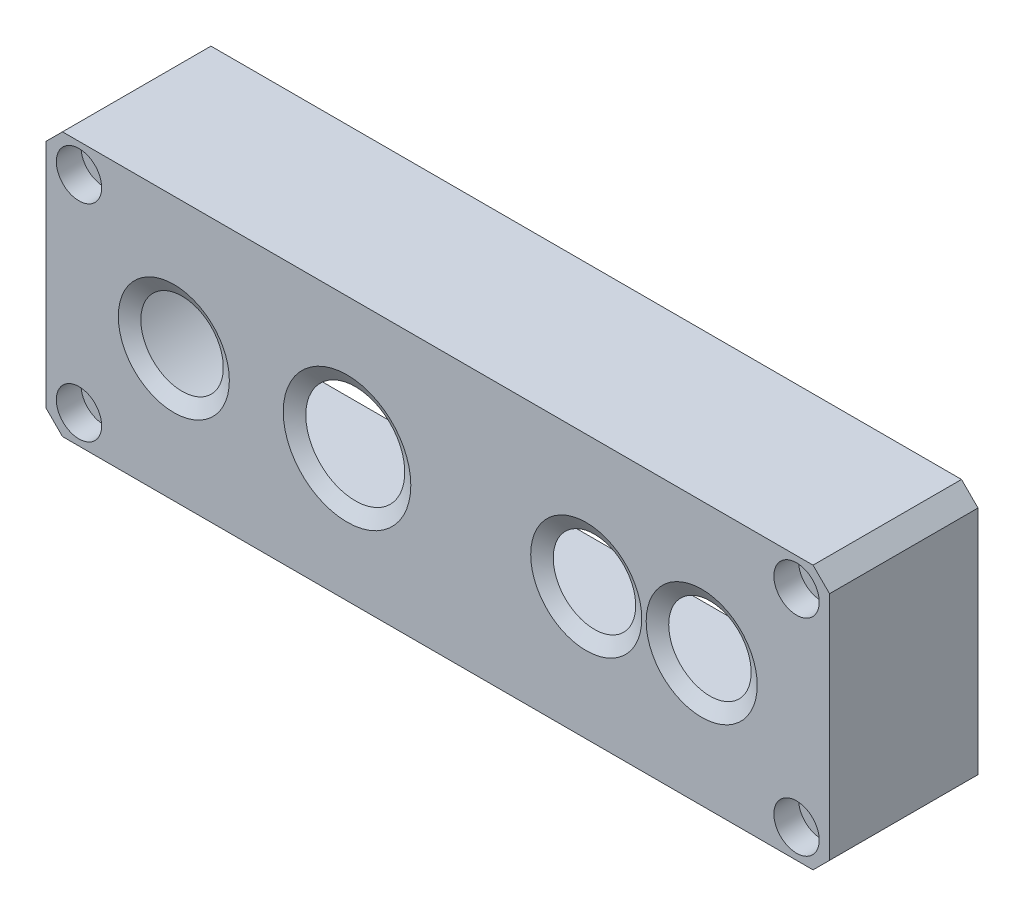
ISO-10303-21;
HEADER;
FILE_DESCRIPTION(('STEP AP214'),'2;1');
FILE_NAME('part.step','',(''),(''),'','','');
FILE_SCHEMA(('AUTOMOTIVE_DESIGN { 1 0 10303 214 1 1 1 1 }'));
ENDSEC;
DATA;
#1=APPLICATION_CONTEXT('core data for automotive mechanical design processes');
#2=APPLICATION_PROTOCOL_DEFINITION('international standard','automotive_design',2000,#1);
#3=PRODUCT_CONTEXT('',#1,'mechanical');
#4=PRODUCT('Part','Part','',(#3));
#5=PRODUCT_RELATED_PRODUCT_CATEGORY('part','',(#4));
#6=PRODUCT_DEFINITION_FORMATION('','',#4);
#7=PRODUCT_DEFINITION_CONTEXT('part definition',#1,'design');
#8=PRODUCT_DEFINITION('design','',#6,#7);
#9=PRODUCT_DEFINITION_SHAPE('','',#8);
#10=(LENGTH_UNIT() NAMED_UNIT(*) SI_UNIT(.MILLI.,.METRE.));
#11=(NAMED_UNIT(*) PLANE_ANGLE_UNIT() SI_UNIT($,.RADIAN.));
#12=(NAMED_UNIT(*) SI_UNIT($,.STERADIAN.) SOLID_ANGLE_UNIT());
#13=UNCERTAINTY_MEASURE_WITH_UNIT(LENGTH_MEASURE(1.E-05),#10,'distance_accuracy_value','');
#14=(GEOMETRIC_REPRESENTATION_CONTEXT(3) GLOBAL_UNCERTAINTY_ASSIGNED_CONTEXT((#13)) GLOBAL_UNIT_ASSIGNED_CONTEXT((#10,
#11,#12)) REPRESENTATION_CONTEXT('',''));
#15=CARTESIAN_POINT('',(0.,0.,0.));
#16=DIRECTION('',(0.,0.,1.));
#17=DIRECTION('',(1.,0.,0.));
#18=AXIS2_PLACEMENT_3D('',#15,#16,#17);
#19=CARTESIAN_POINT('',(-227.462722424265,79.6239283126375,1.));
#20=DIRECTION('',(0.,0.,-1.));
#21=DIRECTION('',(-1.,0.,0.));
#22=AXIS2_PLACEMENT_3D('',#19,#20,#21);
#23=CYLINDRICAL_SURFACE('',#22,1.30000000000001);
#24=CARTESIAN_POINT('',(-227.462722424265,79.6239283126375,-17.));
#25=DIRECTION('',(0.,0.,-1.));
#26=DIRECTION('',(-1.,0.,0.));
#27=AXIS2_PLACEMENT_3D('',#24,#25,#26);
#28=CIRCLE('',#27,1.30000000000001);
#29=CARTESIAN_POINT('',(-228.762722424265,79.6239283126375,-17.));
#30=VERTEX_POINT('',#29);
#31=EDGE_CURVE('E275',#30,#30,#28,.T.);
#32=ORIENTED_EDGE('',*,*,#31,.T.);
#33=EDGE_LOOP('',(#32));
#34=FACE_BOUND('',#33,.T.);
#35=CARTESIAN_POINT('',(-227.462722424265,79.6239283126375,-2.));
#36=DIRECTION('',(0.,0.,1.));
#37=DIRECTION('',(1.,0.,0.));
#38=AXIS2_PLACEMENT_3D('',#35,#36,#37);
#39=CIRCLE('',#38,1.30000000000001);
#40=CARTESIAN_POINT('',(-226.162722424265,79.6239283126375,-2.));
#41=VERTEX_POINT('',#40);
#42=EDGE_CURVE('E43',#41,#41,#39,.F.);
#43=ORIENTED_EDGE('',*,*,#42,.F.);
#44=EDGE_LOOP('',(#43));
#45=FACE_BOUND('',#44,.T.);
#46=ADVANCED_FACE('F39',(#34,#45),#23,.F.);
#47=CARTESIAN_POINT('',(-140.462722424265,104.623928312638,1.));
#48=DIRECTION('',(0.,0.,-1.));
#49=DIRECTION('',(-1.,0.,0.));
#50=AXIS2_PLACEMENT_3D('',#47,#48,#49);
#51=CYLINDRICAL_SURFACE('',#50,1.30000000000001);
#52=CARTESIAN_POINT('',(-140.462722424265,104.623928312638,-17.));
#53=DIRECTION('',(0.,0.,-1.));
#54=DIRECTION('',(-1.,0.,0.));
#55=AXIS2_PLACEMENT_3D('',#52,#53,#54);
#56=CIRCLE('',#55,1.30000000000001);
#57=CARTESIAN_POINT('',(-141.762722424265,104.623928312638,-17.));
#58=VERTEX_POINT('',#57);
#59=EDGE_CURVE('E259',#58,#58,#56,.T.);
#60=ORIENTED_EDGE('',*,*,#59,.T.);
#61=EDGE_LOOP('',(#60));
#62=FACE_BOUND('',#61,.T.);
#63=CARTESIAN_POINT('',(-140.462722424265,104.623928312638,-2.));
#64=DIRECTION('',(0.,0.,1.));
#65=DIRECTION('',(1.,0.,0.));
#66=AXIS2_PLACEMENT_3D('',#63,#64,#65);
#67=CIRCLE('',#66,1.30000000000001);
#68=CARTESIAN_POINT('',(-139.162722424265,104.623928312638,-2.));
#69=VERTEX_POINT('',#68);
#70=EDGE_CURVE('E254',#69,#69,#67,.F.);
#71=ORIENTED_EDGE('',*,*,#70,.F.);
#72=EDGE_LOOP('',(#71));
#73=FACE_BOUND('',#72,.T.);
#74=ADVANCED_FACE('F294',(#62,#73),#51,.F.);
#75=CARTESIAN_POINT('',(-140.462722424265,79.6239283126375,1.));
#76=DIRECTION('',(0.,0.,-1.));
#77=DIRECTION('',(-1.,0.,0.));
#78=AXIS2_PLACEMENT_3D('',#75,#76,#77);
#79=CYLINDRICAL_SURFACE('',#78,1.30000000000001);
#80=CARTESIAN_POINT('',(-140.462722424265,79.6239283126375,-17.));
#81=DIRECTION('',(0.,0.,-1.));
#82=DIRECTION('',(-1.,0.,0.));
#83=AXIS2_PLACEMENT_3D('',#80,#81,#82);
#84=CIRCLE('',#83,1.30000000000001);
#85=CARTESIAN_POINT('',(-141.762722424265,79.6239283126375,-17.));
#86=VERTEX_POINT('',#85);
#87=EDGE_CURVE('E263',#86,#86,#84,.T.);
#88=ORIENTED_EDGE('',*,*,#87,.T.);
#89=EDGE_LOOP('',(#88));
#90=FACE_BOUND('',#89,.T.);
#91=CARTESIAN_POINT('',(-140.462722424265,79.6239283126375,-2.));
#92=DIRECTION('',(0.,0.,1.));
#93=DIRECTION('',(1.,0.,0.));
#94=AXIS2_PLACEMENT_3D('',#91,#92,#93);
#95=CIRCLE('',#94,1.30000000000001);
#96=CARTESIAN_POINT('',(-139.162722424265,79.6239283126375,-2.));
#97=VERTEX_POINT('',#96);
#98=EDGE_CURVE('E251',#97,#97,#95,.F.);
#99=ORIENTED_EDGE('',*,*,#98,.F.);
#100=EDGE_LOOP('',(#99));
#101=FACE_BOUND('',#100,.T.);
#102=ADVANCED_FACE('F300',(#90,#101),#79,.F.);
#103=CARTESIAN_POINT('',(-227.462722424265,104.623928312638,1.));
#104=DIRECTION('',(0.,0.,-1.));
#105=DIRECTION('',(-1.,0.,0.));
#106=AXIS2_PLACEMENT_3D('',#103,#104,#105);
#107=CYLINDRICAL_SURFACE('',#106,1.30000000000001);
#108=CARTESIAN_POINT('',(-227.462722424265,104.623928312638,-17.));
#109=DIRECTION('',(0.,0.,-1.));
#110=DIRECTION('',(-1.,0.,0.));
#111=AXIS2_PLACEMENT_3D('',#108,#109,#110);
#112=CIRCLE('',#111,1.30000000000001);
#113=CARTESIAN_POINT('',(-228.762722424265,104.623928312638,-17.));
#114=VERTEX_POINT('',#113);
#115=EDGE_CURVE('E268',#114,#114,#112,.T.);
#116=ORIENTED_EDGE('',*,*,#115,.T.);
#117=EDGE_LOOP('',(#116));
#118=FACE_BOUND('',#117,.T.);
#119=CARTESIAN_POINT('',(-227.462722424265,104.623928312638,-2.));
#120=DIRECTION('',(0.,0.,1.));
#121=DIRECTION('',(1.,0.,0.));
#122=AXIS2_PLACEMENT_3D('',#119,#120,#121);
#123=CIRCLE('',#122,1.30000000000001);
#124=CARTESIAN_POINT('',(-226.162722424265,104.623928312638,-2.));
#125=VERTEX_POINT('',#124);
#126=EDGE_CURVE('E248',#125,#125,#123,.F.);
#127=ORIENTED_EDGE('',*,*,#126,.F.);
#128=EDGE_LOOP('',(#127));
#129=FACE_BOUND('',#128,.T.);
#130=ADVANCED_FACE('F325',(#118,#129),#107,.F.);
#131=CARTESIAN_POINT('',(0.,0.,0.));
#132=DIRECTION('',(0.,0.,1.));
#133=DIRECTION('',(1.,0.,0.));
#134=AXIS2_PLACEMENT_3D('',#131,#132,#133);
#135=PLANE('',#134);
#136=CARTESIAN_POINT('',(-194.962722424265,92.1239283126375,0.));
#137=DIRECTION('',(0.,0.,-1.));
#138=DIRECTION('',(-1.,0.,0.));
#139=AXIS2_PLACEMENT_3D('',#136,#137,#138);
#140=CIRCLE('',#139,6.00000000000002);
#141=CARTESIAN_POINT('',(-200.962722424265,92.1239283126375,0.));
#142=VERTEX_POINT('',#141);
#143=EDGE_CURVE('E171',#142,#142,#140,.T.);
#144=ORIENTED_EDGE('',*,*,#143,.F.);
#145=EDGE_LOOP('',(#144));
#146=FACE_BOUND('',#145,.T.);
#147=CARTESIAN_POINT('',(-165.962722424265,92.1239283126375,0.));
#148=DIRECTION('',(0.,0.,-1.));
#149=DIRECTION('',(-1.,0.,0.));
#150=AXIS2_PLACEMENT_3D('',#147,#148,#149);
#151=CIRCLE('',#150,4.99999999999999);
#152=CARTESIAN_POINT('',(-170.962722424265,92.1239283126375,0.));
#153=VERTEX_POINT('',#152);
#154=EDGE_CURVE('E174',#153,#153,#151,.T.);
#155=ORIENTED_EDGE('',*,*,#154,.F.);
#156=EDGE_LOOP('',(#155));
#157=FACE_BOUND('',#156,.T.);
#158=CARTESIAN_POINT('',(-151.962722424265,92.1239283126375,0.));
#159=DIRECTION('',(0.,0.,-1.));
#160=DIRECTION('',(-1.,0.,0.));
#161=AXIS2_PLACEMENT_3D('',#158,#159,#160);
#162=CIRCLE('',#161,5.00000000000002);
#163=CARTESIAN_POINT('',(-156.962722424265,92.1239283126375,0.));
#164=VERTEX_POINT('',#163);
#165=EDGE_CURVE('E141',#164,#164,#162,.T.);
#166=ORIENTED_EDGE('',*,*,#165,.F.);
#167=EDGE_LOOP('',(#166));
#168=FACE_BOUND('',#167,.T.);
#169=CARTESIAN_POINT('',(-215.962722424265,92.1239283126375,0.));
#170=DIRECTION('',(0.,0.,-1.));
#171=DIRECTION('',(-1.,0.,0.));
#172=AXIS2_PLACEMENT_3D('',#169,#170,#171);
#173=CIRCLE('',#172,5.00000000000002);
#174=CARTESIAN_POINT('',(-220.962722424265,92.1239283126375,0.));
#175=VERTEX_POINT('',#174);
#176=EDGE_CURVE('E167',#175,#175,#173,.T.);
#177=ORIENTED_EDGE('',*,*,#176,.F.);
#178=EDGE_LOOP('',(#177));
#179=FACE_BOUND('',#178,.T.);
#180=CARTESIAN_POINT('',(-216.962722424265,92.1239283126376,0.));
#181=DIRECTION('',(0.,0.,-1.));
#182=DIRECTION('',(-1.,0.,0.));
#183=AXIS2_PLACEMENT_3D('',#180,#181,#182);
#184=CIRCLE('',#183,12.5);
#185=CARTESIAN_POINT('',(-216.962722424265,79.6239283126376,0.));
#186=VERTEX_POINT('',#185);
#187=CARTESIAN_POINT('',(-216.962722424265,104.623928312638,0.));
#188=VERTEX_POINT('',#187);
#189=EDGE_CURVE('E56',#186,#188,#184,.T.);
#190=ORIENTED_EDGE('',*,*,#189,.T.);
#191=DIRECTION('',(1.,0.,0.));
#192=VECTOR('',#191,1.);
#193=CARTESIAN_POINT('',(0.,104.623928312638,0.));
#194=LINE('',#193,#192);
#195=CARTESIAN_POINT('',(-150.962722424265,104.623928312638,0.));
#196=VERTEX_POINT('',#195);
#197=EDGE_CURVE('E156',#188,#196,#194,.T.);
#198=ORIENTED_EDGE('',*,*,#197,.T.);
#199=CARTESIAN_POINT('',(-150.962722424265,92.1239283126375,0.));
#200=DIRECTION('',(0.,0.,-1.));
#201=DIRECTION('',(-1.,0.,0.));
#202=AXIS2_PLACEMENT_3D('',#199,#200,#201);
#203=CIRCLE('',#202,12.5);
#204=CARTESIAN_POINT('',(-150.962722424265,79.6239283126375,0.));
#205=VERTEX_POINT('',#204);
#206=EDGE_CURVE('E64',#196,#205,#203,.T.);
#207=ORIENTED_EDGE('',*,*,#206,.T.);
#208=DIRECTION('',(1.,0.,0.));
#209=VECTOR('',#208,1.);
#210=CARTESIAN_POINT('',(0.,79.6239283126375,0.));
#211=LINE('',#210,#209);
#212=EDGE_CURVE('E160',#186,#205,#211,.T.);
#213=ORIENTED_EDGE('',*,*,#212,.F.);
#214=EDGE_LOOP('',(#190,#198,#207,#213));
#215=FACE_BOUND('',#214,.T.);
#216=ADVANCED_FACE('F279',(#146,#157,#168,#179,#215),#135,.F.);
#217=CARTESIAN_POINT('',(-15.1693970558127,-15.1693970558129,-17.));
#218=DIRECTION('',(-0.707106781186543,-0.707106781186552,0.));
#219=DIRECTION('',(0.707106781186552,-0.707106781186543,0.));
#220=AXIS2_PLACEMENT_3D('',#217,#218,#219);
#221=PLANE('',#220);
#222=DIRECTION('',(0.,0.,1.));
#223=VECTOR('',#222,1.);
#224=CARTESIAN_POINT('',(-138.462722424265,108.123928312638,-17.));
#225=LINE('',#224,#223);
#226=CARTESIAN_POINT('',(-138.462722424265,108.123928312638,-17.));
#227=VERTEX_POINT('',#226);
#228=CARTESIAN_POINT('',(-138.462722424265,108.123928312638,1.));
#229=VERTEX_POINT('',#228);
#230=EDGE_CURVE('E234',#227,#229,#225,.T.);
#231=ORIENTED_EDGE('',*,*,#230,.T.);
#232=DIRECTION('',(-0.707106781186552,0.707106781186543,0.));
#233=VECTOR('',#232,1.);
#234=CARTESIAN_POINT('',(-136.462722424265,106.123928312638,1.));
#235=LINE('',#234,#233);
#236=CARTESIAN_POINT('',(-136.462722424265,106.123928312638,1.));
#237=VERTEX_POINT('',#236);
#238=EDGE_CURVE('E211',#237,#229,#235,.T.);
#239=ORIENTED_EDGE('',*,*,#238,.F.);
#240=DIRECTION('',(0.,0.,1.));
#241=VECTOR('',#240,1.);
#242=CARTESIAN_POINT('',(-136.462722424265,106.123928312638,-17.));
#243=LINE('',#242,#241);
#244=CARTESIAN_POINT('',(-136.462722424265,106.123928312638,-17.));
#245=VERTEX_POINT('',#244);
#246=EDGE_CURVE('E11',#245,#237,#243,.T.);
#247=ORIENTED_EDGE('',*,*,#246,.F.);
#248=DIRECTION('',(0.707106781186552,-0.707106781186543,0.));
#249=VECTOR('',#248,1.);
#250=CARTESIAN_POINT('',(-15.1693970558127,-15.1693970558129,-17.));
#251=LINE('',#250,#249);
#252=EDGE_CURVE('E214',#227,#245,#251,.T.);
#253=ORIENTED_EDGE('',*,*,#252,.F.);
#254=EDGE_LOOP('',(#231,#239,#247,#253));
#255=FACE_BOUND('',#254,.T.);
#256=ADVANCED_FACE('F41',(#255),#221,.F.);
#257=CARTESIAN_POINT('',(-136.462722424265,0.,-17.));
#258=DIRECTION('',(-1.,0.,0.));
#259=DIRECTION('',(0.,0.,1.));
#260=AXIS2_PLACEMENT_3D('',#257,#258,#259);
#261=PLANE('',#260);
#262=ORIENTED_EDGE('',*,*,#246,.T.);
#263=DIRECTION('',(0.,1.,0.));
#264=VECTOR('',#263,1.);
#265=CARTESIAN_POINT('',(-136.462722424265,78.1239283126375,1.));
#266=LINE('',#265,#264);
#267=CARTESIAN_POINT('',(-136.462722424265,78.1239283126375,1.));
#268=VERTEX_POINT('',#267);
#269=EDGE_CURVE('E208',#268,#237,#266,.T.);
#270=ORIENTED_EDGE('',*,*,#269,.F.);
#271=DIRECTION('',(0.,0.,1.));
#272=VECTOR('',#271,1.);
#273=CARTESIAN_POINT('',(-136.462722424265,78.1239283126375,-17.));
#274=LINE('',#273,#272);
#275=CARTESIAN_POINT('',(-136.462722424265,78.1239283126375,-17.));
#276=VERTEX_POINT('',#275);
#277=EDGE_CURVE('E48',#276,#268,#274,.T.);
#278=ORIENTED_EDGE('',*,*,#277,.F.);
#279=DIRECTION('',(0.,-1.,0.));
#280=VECTOR('',#279,1.);
#281=CARTESIAN_POINT('',(-136.462722424265,0.,-17.));
#282=LINE('',#281,#280);
#283=EDGE_CURVE('E233',#245,#276,#282,.T.);
#284=ORIENTED_EDGE('',*,*,#283,.F.);
#285=EDGE_LOOP('',(#262,#270,#278,#284));
#286=FACE_BOUND('',#285,.T.);
#287=ADVANCED_FACE('F450',(#286),#261,.F.);
#288=CARTESIAN_POINT('',(-107.293325368451,107.293325368451,-17.));
#289=DIRECTION('',(0.707106781186547,-0.707106781186547,0.));
#290=DIRECTION('',(0.707106781186548,0.707106781186548,0.));
#291=AXIS2_PLACEMENT_3D('',#288,#289,#290);
#292=PLANE('',#291);
#293=ORIENTED_EDGE('',*,*,#277,.T.);
#294=DIRECTION('',(0.707106781186547,0.707106781186547,0.));
#295=VECTOR('',#294,1.);
#296=CARTESIAN_POINT('',(-138.462722424265,76.1239283126375,1.));
#297=LINE('',#296,#295);
#298=CARTESIAN_POINT('',(-138.462722424265,76.1239283126375,1.));
#299=VERTEX_POINT('',#298);
#300=EDGE_CURVE('E205',#299,#268,#297,.T.);
#301=ORIENTED_EDGE('',*,*,#300,.F.);
#302=DIRECTION('',(0.,0.,1.));
#303=VECTOR('',#302,1.);
#304=CARTESIAN_POINT('',(-138.462722424265,76.1239283126375,-17.));
#305=LINE('',#304,#303);
#306=CARTESIAN_POINT('',(-138.462722424265,76.1239283126375,-17.));
#307=VERTEX_POINT('',#306);
#308=EDGE_CURVE('E237',#307,#299,#305,.T.);
#309=ORIENTED_EDGE('',*,*,#308,.F.);
#310=DIRECTION('',(0.707106781186548,0.707106781186548,0.));
#311=VECTOR('',#310,1.);
#312=CARTESIAN_POINT('',(-107.293325368451,107.293325368451,-17.));
#313=LINE('',#312,#311);
#314=EDGE_CURVE('E230',#307,#276,#313,.T.);
#315=ORIENTED_EDGE('',*,*,#314,.T.);
#316=EDGE_LOOP('',(#293,#301,#309,#315));
#317=FACE_BOUND('',#316,.T.);
#318=ADVANCED_FACE('F446',(#317),#292,.T.);
#319=CARTESIAN_POINT('',(0.,76.1239283126375,-17.));
#320=DIRECTION('',(0.,-1.,0.));
#321=DIRECTION('',(0.,0.,-1.));
#322=AXIS2_PLACEMENT_3D('',#319,#320,#321);
#323=PLANE('',#322);
#324=ORIENTED_EDGE('',*,*,#308,.T.);
#325=DIRECTION('',(1.,0.,0.));
#326=VECTOR('',#325,1.);
#327=CARTESIAN_POINT('',(-229.462722424265,76.1239283126375,1.));
#328=LINE('',#327,#326);
#329=CARTESIAN_POINT('',(-229.462722424265,76.1239283126375,1.));
#330=VERTEX_POINT('',#329);
#331=EDGE_CURVE('E202',#330,#299,#328,.T.);
#332=ORIENTED_EDGE('',*,*,#331,.F.);
#333=DIRECTION('',(0.,0.,1.));
#334=VECTOR('',#333,1.);
#335=CARTESIAN_POINT('',(-229.462722424265,76.1239283126375,-17.));
#336=LINE('',#335,#334);
#337=CARTESIAN_POINT('',(-229.462722424265,76.1239283126375,-17.));
#338=VERTEX_POINT('',#337);
#339=EDGE_CURVE('E239',#338,#330,#336,.T.);
#340=ORIENTED_EDGE('',*,*,#339,.F.);
#341=DIRECTION('',(1.,0.,0.));
#342=VECTOR('',#341,1.);
#343=CARTESIAN_POINT('',(0.,76.1239283126375,-17.));
#344=LINE('',#343,#342);
#345=EDGE_CURVE('E227',#338,#307,#344,.T.);
#346=ORIENTED_EDGE('',*,*,#345,.T.);
#347=EDGE_LOOP('',(#324,#332,#340,#346));
#348=FACE_BOUND('',#347,.T.);
#349=ADVANCED_FACE('F442',(#348),#323,.T.);
#350=CARTESIAN_POINT('',(-76.6693970558121,-76.6693970558131,-17.));
#351=DIRECTION('',(-0.707106781186543,-0.707106781186552,0.));
#352=DIRECTION('',(0.707106781186552,-0.707106781186543,0.));
#353=AXIS2_PLACEMENT_3D('',#350,#351,#352);
#354=PLANE('',#353);
#355=ORIENTED_EDGE('',*,*,#339,.T.);
#356=DIRECTION('',(0.707106781186552,-0.707106781186542,0.));
#357=VECTOR('',#356,1.);
#358=CARTESIAN_POINT('',(-231.462722424265,78.1239283126375,1.));
#359=LINE('',#358,#357);
#360=CARTESIAN_POINT('',(-231.462722424265,78.1239283126375,1.));
#361=VERTEX_POINT('',#360);
#362=EDGE_CURVE('E199',#361,#330,#359,.T.);
#363=ORIENTED_EDGE('',*,*,#362,.F.);
#364=DIRECTION('',(0.,0.,1.));
#365=VECTOR('',#364,1.);
#366=CARTESIAN_POINT('',(-231.462722424265,78.1239283126375,-17.));
#367=LINE('',#366,#365);
#368=CARTESIAN_POINT('',(-231.462722424265,78.1239283126375,-17.));
#369=VERTEX_POINT('',#368);
#370=EDGE_CURVE('E241',#369,#361,#367,.T.);
#371=ORIENTED_EDGE('',*,*,#370,.F.);
#372=DIRECTION('',(0.707106781186552,-0.707106781186543,0.));
#373=VECTOR('',#372,1.);
#374=CARTESIAN_POINT('',(-76.6693970558121,-76.6693970558131,-17.));
#375=LINE('',#374,#373);
#376=EDGE_CURVE('E224',#369,#338,#375,.T.);
#377=ORIENTED_EDGE('',*,*,#376,.T.);
#378=EDGE_LOOP('',(#355,#363,#371,#377));
#379=FACE_BOUND('',#378,.T.);
#380=ADVANCED_FACE('F438',(#379),#354,.T.);
#381=CARTESIAN_POINT('',(-231.462722424265,0.,-17.));
#382=DIRECTION('',(-1.,0.,0.));
#383=DIRECTION('',(0.,0.,1.));
#384=AXIS2_PLACEMENT_3D('',#381,#382,#383);
#385=PLANE('',#384);
#386=ORIENTED_EDGE('',*,*,#370,.T.);
#387=DIRECTION('',(0.,-1.,0.));
#388=VECTOR('',#387,1.);
#389=CARTESIAN_POINT('',(-231.462722424265,106.123928312638,1.));
#390=LINE('',#389,#388);
#391=CARTESIAN_POINT('',(-231.462722424265,106.123928312638,1.));
#392=VERTEX_POINT('',#391);
#393=EDGE_CURVE('E196',#392,#361,#390,.T.);
#394=ORIENTED_EDGE('',*,*,#393,.F.);
#395=DIRECTION('',(0.,0.,1.));
#396=VECTOR('',#395,1.);
#397=CARTESIAN_POINT('',(-231.462722424265,106.123928312638,-17.));
#398=LINE('',#397,#396);
#399=CARTESIAN_POINT('',(-231.462722424265,106.123928312638,-17.));
#400=VERTEX_POINT('',#399);
#401=EDGE_CURVE('E243',#400,#392,#398,.T.);
#402=ORIENTED_EDGE('',*,*,#401,.F.);
#403=DIRECTION('',(0.,-1.,0.));
#404=VECTOR('',#403,1.);
#405=CARTESIAN_POINT('',(-231.462722424265,0.,-17.));
#406=LINE('',#405,#404);
#407=EDGE_CURVE('E221',#400,#369,#406,.T.);
#408=ORIENTED_EDGE('',*,*,#407,.T.);
#409=EDGE_LOOP('',(#386,#394,#402,#408));
#410=FACE_BOUND('',#409,.T.);
#411=ADVANCED_FACE('F434',(#410),#385,.T.);
#412=CARTESIAN_POINT('',(-168.793325368451,168.793325368451,-17.));
#413=DIRECTION('',(0.707106781186547,-0.707106781186547,0.));
#414=DIRECTION('',(0.707106781186548,0.707106781186548,0.));
#415=AXIS2_PLACEMENT_3D('',#412,#413,#414);
#416=PLANE('',#415);
#417=ORIENTED_EDGE('',*,*,#401,.T.);
#418=DIRECTION('',(-0.707106781186547,-0.707106781186547,0.));
#419=VECTOR('',#418,1.);
#420=CARTESIAN_POINT('',(-229.462722424265,108.123928312638,1.));
#421=LINE('',#420,#419);
#422=CARTESIAN_POINT('',(-229.462722424265,108.123928312638,1.));
#423=VERTEX_POINT('',#422);
#424=EDGE_CURVE('E193',#423,#392,#421,.T.);
#425=ORIENTED_EDGE('',*,*,#424,.F.);
#426=DIRECTION('',(0.,0.,1.));
#427=VECTOR('',#426,1.);
#428=CARTESIAN_POINT('',(-229.462722424265,108.123928312638,-17.));
#429=LINE('',#428,#427);
#430=CARTESIAN_POINT('',(-229.462722424265,108.123928312638,-17.));
#431=VERTEX_POINT('',#430);
#432=EDGE_CURVE('E245',#431,#423,#429,.T.);
#433=ORIENTED_EDGE('',*,*,#432,.F.);
#434=DIRECTION('',(0.707106781186548,0.707106781186548,0.));
#435=VECTOR('',#434,1.);
#436=CARTESIAN_POINT('',(-168.793325368451,168.793325368451,-17.));
#437=LINE('',#436,#435);
#438=EDGE_CURVE('E219',#400,#431,#437,.T.);
#439=ORIENTED_EDGE('',*,*,#438,.F.);
#440=EDGE_LOOP('',(#417,#425,#433,#439));
#441=FACE_BOUND('',#440,.T.);
#442=ADVANCED_FACE('F431',(#441),#416,.F.);
#443=CARTESIAN_POINT('',(0.,108.123928312637,-17.));
#444=DIRECTION('',(0.,-1.,0.));
#445=DIRECTION('',(1.,0.,0.));
#446=AXIS2_PLACEMENT_3D('',#443,#444,#445);
#447=PLANE('',#446);
#448=ORIENTED_EDGE('',*,*,#432,.T.);
#449=DIRECTION('',(-1.,0.,0.));
#450=VECTOR('',#449,1.);
#451=CARTESIAN_POINT('',(-138.462722424265,108.123928312638,1.));
#452=LINE('',#451,#450);
#453=EDGE_CURVE('E190',#229,#423,#452,.T.);
#454=ORIENTED_EDGE('',*,*,#453,.F.);
#455=ORIENTED_EDGE('',*,*,#230,.F.);
#456=DIRECTION('',(1.,0.,0.));
#457=VECTOR('',#456,1.);
#458=CARTESIAN_POINT('',(0.,108.123928312637,-17.));
#459=LINE('',#458,#457);
#460=EDGE_CURVE('E217',#431,#227,#459,.T.);
#461=ORIENTED_EDGE('',*,*,#460,.F.);
#462=EDGE_LOOP('',(#448,#454,#455,#461));
#463=FACE_BOUND('',#462,.T.);
#464=ADVANCED_FACE('F342',(#463),#447,.F.);
#465=CARTESIAN_POINT('',(0.,0.,-17.));
#466=DIRECTION('',(0.,0.,1.));
#467=DIRECTION('',(1.,0.,0.));
#468=AXIS2_PLACEMENT_3D('',#465,#466,#467);
#469=PLANE('',#468);
#470=ORIENTED_EDGE('',*,*,#115,.F.);
#471=EDGE_LOOP('',(#470));
#472=FACE_BOUND('',#471,.T.);
#473=ORIENTED_EDGE('',*,*,#87,.F.);
#474=EDGE_LOOP('',(#473));
#475=FACE_BOUND('',#474,.T.);
#476=ORIENTED_EDGE('',*,*,#59,.F.);
#477=EDGE_LOOP('',(#476));
#478=FACE_BOUND('',#477,.T.);
#479=ORIENTED_EDGE('',*,*,#31,.F.);
#480=EDGE_LOOP('',(#479));
#481=FACE_BOUND('',#480,.T.);
#482=CARTESIAN_POINT('',(-150.962722424265,92.1239283126375,-17.));
#483=DIRECTION('',(0.,0.,1.));
#484=DIRECTION('',(1.,0.,0.));
#485=AXIS2_PLACEMENT_3D('',#482,#483,#484);
#486=CIRCLE('',#485,12.5);
#487=CARTESIAN_POINT('',(-150.962722424265,79.6239283126375,-17.));
#488=VERTEX_POINT('',#487);
#489=CARTESIAN_POINT('',(-150.962722424265,104.623928312638,-17.));
#490=VERTEX_POINT('',#489);
#491=EDGE_CURVE('E132',#488,#490,#486,.T.);
#492=ORIENTED_EDGE('',*,*,#491,.T.);
#493=DIRECTION('',(-1.,0.,0.));
#494=VECTOR('',#493,1.);
#495=CARTESIAN_POINT('',(0.,104.623928312638,-17.));
#496=LINE('',#495,#494);
#497=CARTESIAN_POINT('',(-216.962722424265,104.623928312638,-17.));
#498=VERTEX_POINT('',#497);
#499=EDGE_CURVE('E136',#490,#498,#496,.T.);
#500=ORIENTED_EDGE('',*,*,#499,.T.);
#501=CARTESIAN_POINT('',(-216.962722424265,92.1239283126376,-17.));
#502=DIRECTION('',(0.,0.,1.));
#503=DIRECTION('',(1.,0.,0.));
#504=AXIS2_PLACEMENT_3D('',#501,#502,#503);
#505=CIRCLE('',#504,12.5);
#506=CARTESIAN_POINT('',(-216.962722424265,79.6239283126376,-17.));
#507=VERTEX_POINT('',#506);
#508=EDGE_CURVE('E142',#498,#507,#505,.T.);
#509=ORIENTED_EDGE('',*,*,#508,.T.);
#510=DIRECTION('',(-1.,0.,0.));
#511=VECTOR('',#510,1.);
#512=CARTESIAN_POINT('',(0.,79.6239283126375,-17.));
#513=LINE('',#512,#511);
#514=EDGE_CURVE('E139',#488,#507,#513,.T.);
#515=ORIENTED_EDGE('',*,*,#514,.F.);
#516=EDGE_LOOP('',(#492,#500,#509,#515));
#517=FACE_BOUND('',#516,.T.);
#518=ORIENTED_EDGE('',*,*,#252,.T.);
#519=ORIENTED_EDGE('',*,*,#283,.T.);
#520=ORIENTED_EDGE('',*,*,#314,.F.);
#521=ORIENTED_EDGE('',*,*,#345,.F.);
#522=ORIENTED_EDGE('',*,*,#376,.F.);
#523=ORIENTED_EDGE('',*,*,#407,.F.);
#524=ORIENTED_EDGE('',*,*,#438,.T.);
#525=ORIENTED_EDGE('',*,*,#460,.T.);
#526=EDGE_LOOP('',(#518,#519,#520,#521,#522,#523,#524,#525));
#527=FACE_BOUND('',#526,.T.);
#528=ADVANCED_FACE('F133',(#472,#475,#478,#481,#517,#527),#469,.F.);
#529=CARTESIAN_POINT('',(0.,0.,1.));
#530=DIRECTION('',(0.,0.,1.));
#531=DIRECTION('',(1.,0.,0.));
#532=AXIS2_PLACEMENT_3D('',#529,#530,#531);
#533=PLANE('',#532);
#534=CARTESIAN_POINT('',(-140.462722424265,104.623928312638,1.));
#535=DIRECTION('',(0.,0.,1.));
#536=DIRECTION('',(1.,0.,0.));
#537=AXIS2_PLACEMENT_3D('',#534,#535,#536);
#538=CIRCLE('',#537,2.75000000000001);
#539=CARTESIAN_POINT('',(-137.712722424265,104.623928312638,1.));
#540=VERTEX_POINT('',#539);
#541=EDGE_CURVE('E387',#540,#540,#538,.T.);
#542=ORIENTED_EDGE('',*,*,#541,.F.);
#543=EDGE_LOOP('',(#542));
#544=FACE_BOUND('',#543,.T.);
#545=CARTESIAN_POINT('',(-227.462722424265,79.6239283126375,1.));
#546=DIRECTION('',(0.,0.,1.));
#547=DIRECTION('',(1.,0.,0.));
#548=AXIS2_PLACEMENT_3D('',#545,#546,#547);
#549=CIRCLE('',#548,2.75000000000001);
#550=CARTESIAN_POINT('',(-224.712722424265,79.6239283126375,1.));
#551=VERTEX_POINT('',#550);
#552=EDGE_CURVE('E382',#551,#551,#549,.T.);
#553=ORIENTED_EDGE('',*,*,#552,.F.);
#554=EDGE_LOOP('',(#553));
#555=FACE_BOUND('',#554,.T.);
#556=CARTESIAN_POINT('',(-140.462722424265,79.6239283126375,1.));
#557=DIRECTION('',(0.,0.,1.));
#558=DIRECTION('',(1.,0.,0.));
#559=AXIS2_PLACEMENT_3D('',#556,#557,#558);
#560=CIRCLE('',#559,2.75000000000001);
#561=CARTESIAN_POINT('',(-137.712722424265,79.6239283126375,1.));
#562=VERTEX_POINT('',#561);
#563=EDGE_CURVE('E389',#562,#562,#560,.T.);
#564=ORIENTED_EDGE('',*,*,#563,.F.);
#565=EDGE_LOOP('',(#564));
#566=FACE_BOUND('',#565,.T.);
#567=CARTESIAN_POINT('',(-227.462722424265,104.623928312638,1.));
#568=DIRECTION('',(0.,0.,1.));
#569=DIRECTION('',(1.,0.,0.));
#570=AXIS2_PLACEMENT_3D('',#567,#568,#569);
#571=CIRCLE('',#570,2.75000000000001);
#572=CARTESIAN_POINT('',(-224.712722424265,104.623928312638,1.));
#573=VERTEX_POINT('',#572);
#574=EDGE_CURVE('E272',#573,#573,#571,.T.);
#575=ORIENTED_EDGE('',*,*,#574,.F.);
#576=EDGE_LOOP('',(#575));
#577=FACE_BOUND('',#576,.T.);
#578=CARTESIAN_POINT('',(-215.962722424265,92.1239283126375,1.));
#579=DIRECTION('',(0.,0.,1.));
#580=DIRECTION('',(1.,0.,0.));
#581=AXIS2_PLACEMENT_3D('',#578,#579,#580);
#582=CIRCLE('',#581,6.7320508075689);
#583=CARTESIAN_POINT('',(-209.230671616696,92.1239283126375,1.));
#584=VERTEX_POINT('',#583);
#585=EDGE_CURVE('E170',#584,#584,#582,.T.);
#586=ORIENTED_EDGE('',*,*,#585,.F.);
#587=EDGE_LOOP('',(#586));
#588=FACE_BOUND('',#587,.T.);
#589=CARTESIAN_POINT('',(-151.962722424265,92.1239283126375,1.));
#590=DIRECTION('',(0.,0.,1.));
#591=DIRECTION('',(1.,0.,0.));
#592=AXIS2_PLACEMENT_3D('',#589,#590,#591);
#593=CIRCLE('',#592,6.7320508075689);
#594=CARTESIAN_POINT('',(-145.230671616696,92.1239283126375,1.));
#595=VERTEX_POINT('',#594);
#596=EDGE_CURVE('E181',#595,#595,#593,.T.);
#597=ORIENTED_EDGE('',*,*,#596,.F.);
#598=EDGE_LOOP('',(#597));
#599=FACE_BOUND('',#598,.T.);
#600=CARTESIAN_POINT('',(-165.962722424265,92.1239283126375,1.));
#601=DIRECTION('',(0.,0.,1.));
#602=DIRECTION('',(1.,0.,0.));
#603=AXIS2_PLACEMENT_3D('',#600,#601,#602);
#604=CIRCLE('',#603,6.73205080756887);
#605=CARTESIAN_POINT('',(-159.230671616696,92.1239283126375,1.));
#606=VERTEX_POINT('',#605);
#607=EDGE_CURVE('E184',#606,#606,#604,.T.);
#608=ORIENTED_EDGE('',*,*,#607,.F.);
#609=EDGE_LOOP('',(#608));
#610=FACE_BOUND('',#609,.T.);
#611=CARTESIAN_POINT('',(-194.962722424265,92.1239283126375,1.));
#612=DIRECTION('',(0.,0.,1.));
#613=DIRECTION('',(1.,0.,0.));
#614=AXIS2_PLACEMENT_3D('',#611,#612,#613);
#615=CIRCLE('',#614,7.7320508075689);
#616=CARTESIAN_POINT('',(-187.230671616696,92.1239283126375,1.));
#617=VERTEX_POINT('',#616);
#618=EDGE_CURVE('E187',#617,#617,#615,.T.);
#619=ORIENTED_EDGE('',*,*,#618,.F.);
#620=EDGE_LOOP('',(#619));
#621=FACE_BOUND('',#620,.T.);
#622=ORIENTED_EDGE('',*,*,#453,.T.);
#623=ORIENTED_EDGE('',*,*,#424,.T.);
#624=ORIENTED_EDGE('',*,*,#393,.T.);
#625=ORIENTED_EDGE('',*,*,#362,.T.);
#626=ORIENTED_EDGE('',*,*,#331,.T.);
#627=ORIENTED_EDGE('',*,*,#300,.T.);
#628=ORIENTED_EDGE('',*,*,#269,.T.);
#629=ORIENTED_EDGE('',*,*,#238,.T.);
#630=EDGE_LOOP('',(#622,#623,#624,#625,#626,#627,#628,#629));
#631=FACE_BOUND('',#630,.T.);
#632=ADVANCED_FACE('F341',(#544,#555,#566,#577,#588,#599,#610,#621,#631),#533,.T.);
#633=CARTESIAN_POINT('',(-215.962722424265,92.1239283126375,0.));
#634=DIRECTION('',(0.,0.,1.));
#635=DIRECTION('',(-1.,0.,0.));
#636=AXIS2_PLACEMENT_3D('',#633,#634,#635);
#637=CONICAL_SURFACE('',#636,5.00000000000002,1.0471975511966);
#638=ORIENTED_EDGE('',*,*,#585,.T.);
#639=EDGE_LOOP('',(#638));
#640=FACE_BOUND('',#639,.T.);
#641=ORIENTED_EDGE('',*,*,#176,.T.);
#642=EDGE_LOOP('',(#641));
#643=FACE_BOUND('',#642,.T.);
#644=ADVANCED_FACE('F408',(#640,#643),#637,.F.);
#645=CARTESIAN_POINT('',(-151.962722424265,92.1239283126375,0.));
#646=DIRECTION('',(0.,0.,1.));
#647=DIRECTION('',(-1.,0.,0.));
#648=AXIS2_PLACEMENT_3D('',#645,#646,#647);
#649=CONICAL_SURFACE('',#648,5.00000000000002,1.0471975511966);
#650=ORIENTED_EDGE('',*,*,#596,.T.);
#651=EDGE_LOOP('',(#650));
#652=FACE_BOUND('',#651,.T.);
#653=ORIENTED_EDGE('',*,*,#165,.T.);
#654=EDGE_LOOP('',(#653));
#655=FACE_BOUND('',#654,.T.);
#656=ADVANCED_FACE('F489',(#652,#655),#649,.F.);
#657=CARTESIAN_POINT('',(-165.962722424265,92.1239283126375,0.));
#658=DIRECTION('',(0.,0.,1.));
#659=DIRECTION('',(-1.,0.,0.));
#660=AXIS2_PLACEMENT_3D('',#657,#658,#659);
#661=CONICAL_SURFACE('',#660,4.99999999999999,1.0471975511966);
#662=ORIENTED_EDGE('',*,*,#607,.T.);
#663=EDGE_LOOP('',(#662));
#664=FACE_BOUND('',#663,.T.);
#665=ORIENTED_EDGE('',*,*,#154,.T.);
#666=EDGE_LOOP('',(#665));
#667=FACE_BOUND('',#666,.T.);
#668=ADVANCED_FACE('F497',(#664,#667),#661,.F.);
#669=CARTESIAN_POINT('',(-194.962722424265,92.1239283126375,0.));
#670=DIRECTION('',(0.,0.,1.));
#671=DIRECTION('',(-1.,0.,0.));
#672=AXIS2_PLACEMENT_3D('',#669,#670,#671);
#673=CONICAL_SURFACE('',#672,6.00000000000002,1.0471975511966);
#674=ORIENTED_EDGE('',*,*,#618,.T.);
#675=EDGE_LOOP('',(#674));
#676=FACE_BOUND('',#675,.T.);
#677=ORIENTED_EDGE('',*,*,#143,.T.);
#678=EDGE_LOOP('',(#677));
#679=FACE_BOUND('',#678,.T.);
#680=ADVANCED_FACE('F291',(#676,#679),#673,.F.);
#681=CARTESIAN_POINT('',(0.,79.6239283126375,-109.070625065761));
#682=DIRECTION('',(0.,-1.,0.));
#683=DIRECTION('',(1.,0.,0.));
#684=AXIS2_PLACEMENT_3D('',#681,#682,#683);
#685=PLANE('',#684);
#686=DIRECTION('',(0.,0.,1.));
#687=VECTOR('',#686,1.);
#688=CARTESIAN_POINT('',(-150.962722424265,79.6239283126375,-109.070625065761));
#689=LINE('',#688,#687);
#690=EDGE_CURVE('E162',#488,#205,#689,.T.);
#691=ORIENTED_EDGE('',*,*,#690,.F.);
#692=ORIENTED_EDGE('',*,*,#514,.T.);
#693=DIRECTION('',(0.,0.,1.));
#694=VECTOR('',#693,1.);
#695=CARTESIAN_POINT('',(-216.962722424265,79.6239283126376,-109.070625065761));
#696=LINE('',#695,#694);
#697=EDGE_CURVE('E164',#507,#186,#696,.T.);
#698=ORIENTED_EDGE('',*,*,#697,.T.);
#699=ORIENTED_EDGE('',*,*,#212,.T.);
#700=EDGE_LOOP('',(#691,#692,#698,#699));
#701=FACE_BOUND('',#700,.T.);
#702=ADVANCED_FACE('F281',(#701),#685,.F.);
#703=CARTESIAN_POINT('',(-216.962722424265,92.1239283126376,-109.070625065761));
#704=DIRECTION('',(0.,0.,1.));
#705=DIRECTION('',(1.,0.,0.));
#706=AXIS2_PLACEMENT_3D('',#703,#704,#705);
#707=CYLINDRICAL_SURFACE('',#706,12.5);
#708=ORIENTED_EDGE('',*,*,#508,.F.);
#709=DIRECTION('',(0.,0.,1.));
#710=VECTOR('',#709,1.);
#711=CARTESIAN_POINT('',(-216.962722424265,104.623928312638,-109.070625065761));
#712=LINE('',#711,#710);
#713=EDGE_CURVE('E149',#498,#188,#712,.T.);
#714=ORIENTED_EDGE('',*,*,#713,.T.);
#715=ORIENTED_EDGE('',*,*,#189,.F.);
#716=ORIENTED_EDGE('',*,*,#697,.F.);
#717=EDGE_LOOP('',(#708,#714,#715,#716));
#718=FACE_BOUND('',#717,.T.);
#719=ADVANCED_FACE('F283',(#718),#707,.F.);
#720=CARTESIAN_POINT('',(-150.962722424265,92.1239283126375,-109.070625065761));
#721=DIRECTION('',(0.,0.,1.));
#722=DIRECTION('',(1.,0.,0.));
#723=AXIS2_PLACEMENT_3D('',#720,#721,#722);
#724=CYLINDRICAL_SURFACE('',#723,12.5);
#725=ORIENTED_EDGE('',*,*,#491,.F.);
#726=ORIENTED_EDGE('',*,*,#690,.T.);
#727=ORIENTED_EDGE('',*,*,#206,.F.);
#728=DIRECTION('',(0.,0.,1.));
#729=VECTOR('',#728,1.);
#730=CARTESIAN_POINT('',(-150.962722424265,104.623928312638,-109.070625065761));
#731=LINE('',#730,#729);
#732=EDGE_CURVE('E145',#490,#196,#731,.T.);
#733=ORIENTED_EDGE('',*,*,#732,.F.);
#734=EDGE_LOOP('',(#725,#726,#727,#733));
#735=FACE_BOUND('',#734,.T.);
#736=ADVANCED_FACE('F146',(#735),#724,.F.);
#737=CARTESIAN_POINT('',(0.,104.623928312638,-109.070625065761));
#738=DIRECTION('',(0.,-1.,0.));
#739=DIRECTION('',(1.,0.,0.));
#740=AXIS2_PLACEMENT_3D('',#737,#738,#739);
#741=PLANE('',#740);
#742=ORIENTED_EDGE('',*,*,#499,.F.);
#743=ORIENTED_EDGE('',*,*,#732,.T.);
#744=ORIENTED_EDGE('',*,*,#197,.F.);
#745=ORIENTED_EDGE('',*,*,#713,.F.);
#746=EDGE_LOOP('',(#742,#743,#744,#745));
#747=FACE_BOUND('',#746,.T.);
#748=ADVANCED_FACE('F151',(#747),#741,.T.);
#749=CARTESIAN_POINT('',(-227.462722424265,104.623928312638,-2.));
#750=DIRECTION('',(0.,0.,1.));
#751=DIRECTION('',(1.,0.,0.));
#752=AXIS2_PLACEMENT_3D('',#749,#750,#751);
#753=PLANE('',#752);
#754=CARTESIAN_POINT('',(-227.462722424265,104.623928312638,-2.));
#755=DIRECTION('',(0.,0.,1.));
#756=DIRECTION('',(1.,0.,0.));
#757=AXIS2_PLACEMENT_3D('',#754,#755,#756);
#758=CIRCLE('',#757,2.75000000000001);
#759=CARTESIAN_POINT('',(-224.712722424265,104.623928312638,-2.));
#760=VERTEX_POINT('',#759);
#761=EDGE_CURVE('E252',#760,#760,#758,.T.);
#762=ORIENTED_EDGE('',*,*,#761,.T.);
#763=EDGE_LOOP('',(#762));
#764=FACE_BOUND('',#763,.T.);
#765=ORIENTED_EDGE('',*,*,#126,.T.);
#766=EDGE_LOOP('',(#765));
#767=FACE_BOUND('',#766,.T.);
#768=ADVANCED_FACE('F307',(#764,#767),#753,.T.);
#769=CARTESIAN_POINT('',(-227.462722424265,104.623928312638,-2.));
#770=DIRECTION('',(0.,0.,1.));
#771=DIRECTION('',(1.,0.,0.));
#772=AXIS2_PLACEMENT_3D('',#769,#770,#771);
#773=CYLINDRICAL_SURFACE('',#772,2.75000000000001);
#774=ORIENTED_EDGE('',*,*,#761,.F.);
#775=EDGE_LOOP('',(#774));
#776=FACE_BOUND('',#775,.T.);
#777=ORIENTED_EDGE('',*,*,#574,.T.);
#778=EDGE_LOOP('',(#777));
#779=FACE_BOUND('',#778,.T.);
#780=ADVANCED_FACE('F311',(#776,#779),#773,.F.);
#781=CARTESIAN_POINT('',(-140.462722424265,79.6239283126375,-2.));
#782=DIRECTION('',(0.,0.,1.));
#783=DIRECTION('',(1.,0.,0.));
#784=AXIS2_PLACEMENT_3D('',#781,#782,#783);
#785=PLANE('',#784);
#786=CARTESIAN_POINT('',(-140.462722424265,79.6239283126375,-2.));
#787=DIRECTION('',(0.,0.,1.));
#788=DIRECTION('',(1.,0.,0.));
#789=AXIS2_PLACEMENT_3D('',#786,#787,#788);
#790=CIRCLE('',#789,2.75000000000001);
#791=CARTESIAN_POINT('',(-137.712722424265,79.6239283126375,-2.));
#792=VERTEX_POINT('',#791);
#793=EDGE_CURVE('E400',#792,#792,#790,.T.);
#794=ORIENTED_EDGE('',*,*,#793,.T.);
#795=EDGE_LOOP('',(#794));
#796=FACE_BOUND('',#795,.T.);
#797=ORIENTED_EDGE('',*,*,#98,.T.);
#798=EDGE_LOOP('',(#797));
#799=FACE_BOUND('',#798,.T.);
#800=ADVANCED_FACE('F317',(#796,#799),#785,.T.);
#801=CARTESIAN_POINT('',(-140.462722424265,79.6239283126375,-2.));
#802=DIRECTION('',(0.,0.,1.));
#803=DIRECTION('',(1.,0.,0.));
#804=AXIS2_PLACEMENT_3D('',#801,#802,#803);
#805=CYLINDRICAL_SURFACE('',#804,2.75000000000001);
#806=ORIENTED_EDGE('',*,*,#793,.F.);
#807=EDGE_LOOP('',(#806));
#808=FACE_BOUND('',#807,.T.);
#809=ORIENTED_EDGE('',*,*,#563,.T.);
#810=EDGE_LOOP('',(#809));
#811=FACE_BOUND('',#810,.T.);
#812=ADVANCED_FACE('F352',(#808,#811),#805,.F.);
#813=CARTESIAN_POINT('',(-140.462722424265,104.623928312638,-2.));
#814=DIRECTION('',(0.,0.,1.));
#815=DIRECTION('',(1.,0.,0.));
#816=AXIS2_PLACEMENT_3D('',#813,#814,#815);
#817=PLANE('',#816);
#818=CARTESIAN_POINT('',(-140.462722424265,104.623928312638,-2.));
#819=DIRECTION('',(0.,0.,1.));
#820=DIRECTION('',(1.,0.,0.));
#821=AXIS2_PLACEMENT_3D('',#818,#819,#820);
#822=CIRCLE('',#821,2.75000000000001);
#823=CARTESIAN_POINT('',(-137.712722424265,104.623928312638,-2.));
#824=VERTEX_POINT('',#823);
#825=EDGE_CURVE('E384',#824,#824,#822,.T.);
#826=ORIENTED_EDGE('',*,*,#825,.T.);
#827=EDGE_LOOP('',(#826));
#828=FACE_BOUND('',#827,.T.);
#829=ORIENTED_EDGE('',*,*,#70,.T.);
#830=EDGE_LOOP('',(#829));
#831=FACE_BOUND('',#830,.T.);
#832=ADVANCED_FACE('F358',(#828,#831),#817,.T.);
#833=CARTESIAN_POINT('',(-140.462722424265,104.623928312638,-2.));
#834=DIRECTION('',(0.,0.,1.));
#835=DIRECTION('',(1.,0.,0.));
#836=AXIS2_PLACEMENT_3D('',#833,#834,#835);
#837=CYLINDRICAL_SURFACE('',#836,2.75000000000001);
#838=ORIENTED_EDGE('',*,*,#825,.F.);
#839=EDGE_LOOP('',(#838));
#840=FACE_BOUND('',#839,.T.);
#841=ORIENTED_EDGE('',*,*,#541,.T.);
#842=EDGE_LOOP('',(#841));
#843=FACE_BOUND('',#842,.T.);
#844=ADVANCED_FACE('F363',(#840,#843),#837,.F.);
#845=CARTESIAN_POINT('',(-227.462722424265,79.6239283126375,-2.));
#846=DIRECTION('',(0.,0.,1.));
#847=DIRECTION('',(1.,0.,0.));
#848=AXIS2_PLACEMENT_3D('',#845,#846,#847);
#849=PLANE('',#848);
#850=CARTESIAN_POINT('',(-227.462722424265,79.6239283126375,-2.));
#851=DIRECTION('',(0.,0.,1.));
#852=DIRECTION('',(1.,0.,0.));
#853=AXIS2_PLACEMENT_3D('',#850,#851,#852);
#854=CIRCLE('',#853,2.75000000000001);
#855=CARTESIAN_POINT('',(-224.712722424265,79.6239283126375,-2.));
#856=VERTEX_POINT('',#855);
#857=EDGE_CURVE('E379',#856,#856,#854,.T.);
#858=ORIENTED_EDGE('',*,*,#857,.T.);
#859=EDGE_LOOP('',(#858));
#860=FACE_BOUND('',#859,.T.);
#861=ORIENTED_EDGE('',*,*,#42,.T.);
#862=EDGE_LOOP('',(#861));
#863=FACE_BOUND('',#862,.T.);
#864=ADVANCED_FACE('F323',(#860,#863),#849,.T.);
#865=CARTESIAN_POINT('',(-227.462722424265,79.6239283126375,-2.));
#866=DIRECTION('',(0.,0.,1.));
#867=DIRECTION('',(1.,0.,0.));
#868=AXIS2_PLACEMENT_3D('',#865,#866,#867);
#869=CYLINDRICAL_SURFACE('',#868,2.75000000000001);
#870=ORIENTED_EDGE('',*,*,#857,.F.);
#871=EDGE_LOOP('',(#870));
#872=FACE_BOUND('',#871,.T.);
#873=ORIENTED_EDGE('',*,*,#552,.T.);
#874=EDGE_LOOP('',(#873));
#875=FACE_BOUND('',#874,.T.);
#876=ADVANCED_FACE('F369',(#872,#875),#869,.F.);
#877=CLOSED_SHELL('',(#46,#74,#102,#130,#216,#256,#287,#318,#349,#380,#411,#442,#464,#528,#632,
#644,#656,#668,#680,#702,#719,#736,#748,#768,#780,#800,#812,#832,#844,#864,#876));
#878=MANIFOLD_SOLID_BREP('B2',#877);
#879=ADVANCED_BREP_SHAPE_REPRESENTATION('',(#18,#878),#14);
#880=SHAPE_DEFINITION_REPRESENTATION(#9,#879);
ENDSEC;
END-ISO-10303-21;
